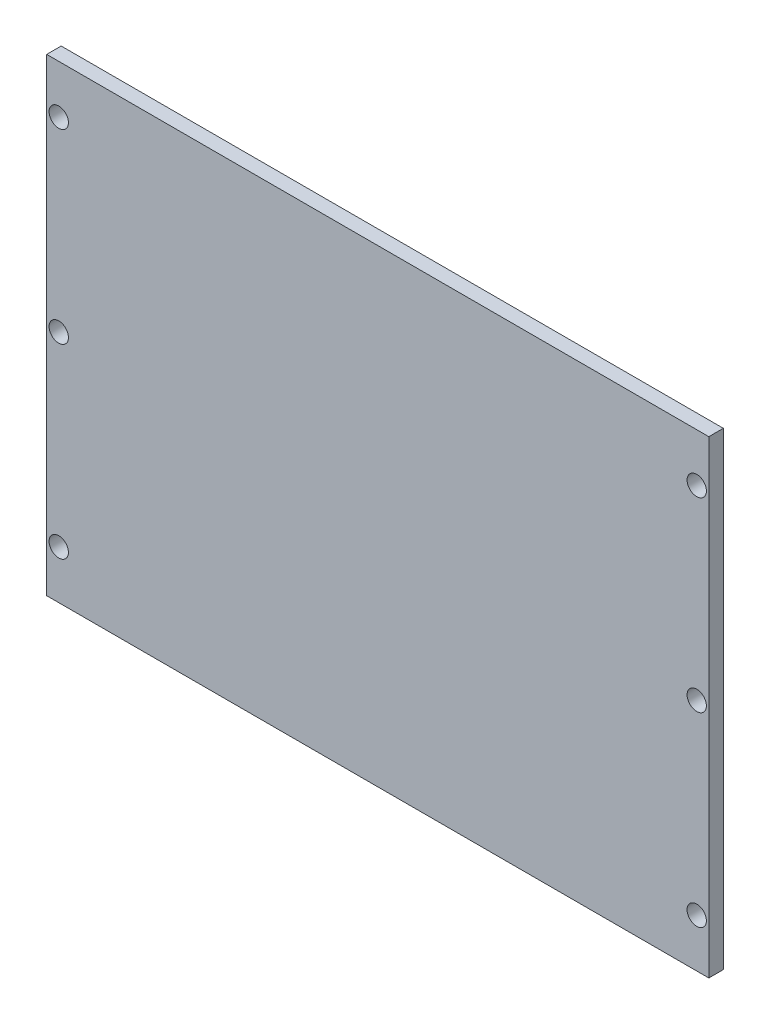
ISO-10303-21;
HEADER;
FILE_DESCRIPTION(('STEP AP214'),'2;1');
FILE_NAME('part.step','',(''),(''),'','','');
FILE_SCHEMA(('AUTOMOTIVE_DESIGN { 1 0 10303 214 1 1 1 1 }'));
ENDSEC;
DATA;
#1=APPLICATION_CONTEXT('core data for automotive mechanical design processes');
#2=APPLICATION_PROTOCOL_DEFINITION('international standard','automotive_design',2000,#1);
#3=PRODUCT_CONTEXT('',#1,'mechanical');
#4=PRODUCT('Part','Part','',(#3));
#5=PRODUCT_RELATED_PRODUCT_CATEGORY('part','',(#4));
#6=PRODUCT_DEFINITION_FORMATION('','',#4);
#7=PRODUCT_DEFINITION_CONTEXT('part definition',#1,'design');
#8=PRODUCT_DEFINITION('design','',#6,#7);
#9=PRODUCT_DEFINITION_SHAPE('','',#8);
#10=(LENGTH_UNIT() NAMED_UNIT(*) SI_UNIT(.MILLI.,.METRE.));
#11=(NAMED_UNIT(*) PLANE_ANGLE_UNIT() SI_UNIT($,.RADIAN.));
#12=(NAMED_UNIT(*) SI_UNIT($,.STERADIAN.) SOLID_ANGLE_UNIT());
#13=UNCERTAINTY_MEASURE_WITH_UNIT(LENGTH_MEASURE(1.E-05),#10,'distance_accuracy_value','');
#14=(GEOMETRIC_REPRESENTATION_CONTEXT(3) GLOBAL_UNCERTAINTY_ASSIGNED_CONTEXT((#13)) GLOBAL_UNIT_ASSIGNED_CONTEXT((#10,
#11,#12)) REPRESENTATION_CONTEXT('',''));
#15=CARTESIAN_POINT('',(0.,0.,0.));
#16=DIRECTION('',(0.,0.,1.));
#17=DIRECTION('',(1.,0.,0.));
#18=AXIS2_PLACEMENT_3D('',#15,#16,#17);
#19=CARTESIAN_POINT('',(30.,2.98999999999998,-206.202765486301));
#20=DIRECTION('',(1.,0.,0.));
#21=DIRECTION('',(0.,0.,-1.));
#22=AXIS2_PLACEMENT_3D('',#19,#20,#21);
#23=PLANE('',#22);
#24=DIRECTION('',(0.,1.,0.));
#25=VECTOR('',#24,1.);
#26=CARTESIAN_POINT('',(30.,2.98999999999998,-197.));
#27=LINE('',#26,#25);
#28=CARTESIAN_POINT('',(30.,3.,-197.));
#29=VERTEX_POINT('',#28);
#30=CARTESIAN_POINT('',(30.,100.,-197.));
#31=VERTEX_POINT('',#30);
#32=EDGE_CURVE('E41',#29,#31,#27,.T.);
#33=ORIENTED_EDGE('',*,*,#32,.T.);
#34=DIRECTION('',(0.,0.,1.));
#35=VECTOR('',#34,1.);
#36=CARTESIAN_POINT('',(30.,100.,-192.));
#37=LINE('',#36,#35);
#38=CARTESIAN_POINT('',(30.,100.,-200.));
#39=VERTEX_POINT('',#38);
#40=EDGE_CURVE('E86',#39,#31,#37,.T.);
#41=ORIENTED_EDGE('',*,*,#40,.F.);
#42=DIRECTION('',(0.,1.,0.));
#43=VECTOR('',#42,1.);
#44=CARTESIAN_POINT('',(30.,100.,-200.));
#45=LINE('',#44,#43);
#46=CARTESIAN_POINT('',(30.,3.,-200.));
#47=VERTEX_POINT('',#46);
#48=EDGE_CURVE('E95',#47,#39,#45,.T.);
#49=ORIENTED_EDGE('',*,*,#48,.F.);
#50=DIRECTION('',(0.,0.,-1.));
#51=VECTOR('',#50,1.);
#52=CARTESIAN_POINT('',(29.9999999999999,3.,0.0100000000000213));
#53=LINE('',#52,#51);
#54=EDGE_CURVE('E62',#29,#47,#53,.T.);
#55=ORIENTED_EDGE('',*,*,#54,.F.);
#56=EDGE_LOOP('',(#33,#41,#49,#55));
#57=FACE_BOUND('',#56,.T.);
#58=ADVANCED_FACE('F37',(#57),#23,.F.);
#59=CARTESIAN_POINT('',(167.,2.98999999999998,-207.082295416591));
#60=DIRECTION('',(-1.,0.,0.));
#61=DIRECTION('',(0.,0.,1.));
#62=AXIS2_PLACEMENT_3D('',#59,#60,#61);
#63=PLANE('',#62);
#64=DIRECTION('',(0.,-1.,0.));
#65=VECTOR('',#64,1.);
#66=CARTESIAN_POINT('',(167.,100.,-200.));
#67=LINE('',#66,#65);
#68=CARTESIAN_POINT('',(167.,100.,-200.));
#69=VERTEX_POINT('',#68);
#70=CARTESIAN_POINT('',(167.,2.99999999999998,-200.));
#71=VERTEX_POINT('',#70);
#72=EDGE_CURVE('E93',#69,#71,#67,.T.);
#73=ORIENTED_EDGE('',*,*,#72,.F.);
#74=DIRECTION('',(0.,0.,-1.));
#75=VECTOR('',#74,1.);
#76=CARTESIAN_POINT('',(167.,100.,-192.));
#77=LINE('',#76,#75);
#78=CARTESIAN_POINT('',(167.,100.,-197.));
#79=VERTEX_POINT('',#78);
#80=EDGE_CURVE('E84',#79,#69,#77,.T.);
#81=ORIENTED_EDGE('',*,*,#80,.F.);
#82=DIRECTION('',(0.,1.,0.));
#83=VECTOR('',#82,1.);
#84=CARTESIAN_POINT('',(167.,2.98999999999998,-197.));
#85=LINE('',#84,#83);
#86=CARTESIAN_POINT('',(167.,2.99999999999998,-197.));
#87=VERTEX_POINT('',#86);
#88=EDGE_CURVE('E92',#87,#79,#85,.T.);
#89=ORIENTED_EDGE('',*,*,#88,.F.);
#90=DIRECTION('',(0.,0.,1.));
#91=VECTOR('',#90,1.);
#92=CARTESIAN_POINT('',(167.,2.99999999999998,0.01000000000001));
#93=LINE('',#92,#91);
#94=EDGE_CURVE('E54',#71,#87,#93,.T.);
#95=ORIENTED_EDGE('',*,*,#94,.F.);
#96=EDGE_LOOP('',(#73,#81,#89,#95));
#97=FACE_BOUND('',#96,.T.);
#98=ADVANCED_FACE('F91',(#97),#63,.F.);
#99=CARTESIAN_POINT('',(167.,2.98999999999998,-197.));
#100=DIRECTION('',(0.,0.,-1.));
#101=DIRECTION('',(-1.,0.,0.));
#102=AXIS2_PLACEMENT_3D('',#99,#100,#101);
#103=PLANE('',#102);
#104=CARTESIAN_POINT('',(32.5,90.,-197.));
#105=DIRECTION('',(0.,0.,1.));
#106=DIRECTION('',(1.,0.,0.));
#107=AXIS2_PLACEMENT_3D('',#104,#105,#106);
#108=CIRCLE('',#107,1.99999999999999);
#109=CARTESIAN_POINT('',(34.5,90.,-197.));
#110=VERTEX_POINT('',#109);
#111=EDGE_CURVE('E144',#110,#110,#108,.T.);
#112=ORIENTED_EDGE('',*,*,#111,.F.);
#113=EDGE_LOOP('',(#112));
#114=FACE_BOUND('',#113,.T.);
#115=CARTESIAN_POINT('',(32.5,51.5,-197.));
#116=DIRECTION('',(0.,0.,1.));
#117=DIRECTION('',(1.,0.,0.));
#118=AXIS2_PLACEMENT_3D('',#115,#116,#117);
#119=CIRCLE('',#118,1.99999999999999);
#120=CARTESIAN_POINT('',(34.5,51.5,-197.));
#121=VERTEX_POINT('',#120);
#122=EDGE_CURVE('E138',#121,#121,#119,.T.);
#123=ORIENTED_EDGE('',*,*,#122,.F.);
#124=EDGE_LOOP('',(#123));
#125=FACE_BOUND('',#124,.T.);
#126=CARTESIAN_POINT('',(32.5,13.,-197.));
#127=DIRECTION('',(0.,0.,1.));
#128=DIRECTION('',(1.,0.,0.));
#129=AXIS2_PLACEMENT_3D('',#126,#127,#128);
#130=CIRCLE('',#129,1.99999999999999);
#131=CARTESIAN_POINT('',(34.5,13.,-197.));
#132=VERTEX_POINT('',#131);
#133=EDGE_CURVE('E132',#132,#132,#130,.T.);
#134=ORIENTED_EDGE('',*,*,#133,.F.);
#135=EDGE_LOOP('',(#134));
#136=FACE_BOUND('',#135,.T.);
#137=CARTESIAN_POINT('',(164.5,13.,-197.));
#138=DIRECTION('',(0.,0.,1.));
#139=DIRECTION('',(1.,0.,0.));
#140=AXIS2_PLACEMENT_3D('',#137,#138,#139);
#141=CIRCLE('',#140,2.);
#142=CARTESIAN_POINT('',(166.5,13.,-197.));
#143=VERTEX_POINT('',#142);
#144=EDGE_CURVE('E126',#143,#143,#141,.T.);
#145=ORIENTED_EDGE('',*,*,#144,.F.);
#146=EDGE_LOOP('',(#145));
#147=FACE_BOUND('',#146,.T.);
#148=CARTESIAN_POINT('',(164.5,51.5,-197.));
#149=DIRECTION('',(0.,0.,1.));
#150=DIRECTION('',(1.,0.,0.));
#151=AXIS2_PLACEMENT_3D('',#148,#149,#150);
#152=CIRCLE('',#151,2.);
#153=CARTESIAN_POINT('',(166.5,51.5,-197.));
#154=VERTEX_POINT('',#153);
#155=EDGE_CURVE('E120',#154,#154,#152,.T.);
#156=ORIENTED_EDGE('',*,*,#155,.F.);
#157=EDGE_LOOP('',(#156));
#158=FACE_BOUND('',#157,.T.);
#159=CARTESIAN_POINT('',(164.5,90.,-197.));
#160=DIRECTION('',(0.,0.,1.));
#161=DIRECTION('',(1.,0.,0.));
#162=AXIS2_PLACEMENT_3D('',#159,#160,#161);
#163=CIRCLE('',#162,2.);
#164=CARTESIAN_POINT('',(166.5,90.,-197.));
#165=VERTEX_POINT('',#164);
#166=EDGE_CURVE('E102',#165,#165,#163,.T.);
#167=ORIENTED_EDGE('',*,*,#166,.F.);
#168=EDGE_LOOP('',(#167));
#169=FACE_BOUND('',#168,.T.);
#170=ORIENTED_EDGE('',*,*,#88,.T.);
#171=DIRECTION('',(-1.,0.,0.));
#172=VECTOR('',#171,1.);
#173=CARTESIAN_POINT('',(162.,100.,-197.));
#174=LINE('',#173,#172);
#175=EDGE_CURVE('E11',#79,#31,#174,.T.);
#176=ORIENTED_EDGE('',*,*,#175,.T.);
#177=ORIENTED_EDGE('',*,*,#32,.F.);
#178=DIRECTION('',(-1.,0.,0.));
#179=VECTOR('',#178,1.);
#180=CARTESIAN_POINT('',(162.,3.,-197.));
#181=LINE('',#180,#179);
#182=EDGE_CURVE('E98',#87,#29,#181,.T.);
#183=ORIENTED_EDGE('',*,*,#182,.F.);
#184=EDGE_LOOP('',(#170,#176,#177,#183));
#185=FACE_BOUND('',#184,.T.);
#186=ADVANCED_FACE('F97',(#114,#125,#136,#147,#158,#169,#185),#103,.F.);
#187=CARTESIAN_POINT('',(8.,100.,-192.));
#188=DIRECTION('',(0.,-1.,0.));
#189=DIRECTION('',(0.,0.,-1.));
#190=AXIS2_PLACEMENT_3D('',#187,#188,#189);
#191=PLANE('',#190);
#192=ORIENTED_EDGE('',*,*,#40,.T.);
#193=ORIENTED_EDGE('',*,*,#175,.F.);
#194=ORIENTED_EDGE('',*,*,#80,.T.);
#195=DIRECTION('',(-1.,0.,0.));
#196=VECTOR('',#195,1.);
#197=CARTESIAN_POINT('',(8.00000000000006,100.,-200.));
#198=LINE('',#197,#196);
#199=EDGE_CURVE('E46',#69,#39,#198,.T.);
#200=ORIENTED_EDGE('',*,*,#199,.T.);
#201=EDGE_LOOP('',(#192,#193,#194,#200));
#202=FACE_BOUND('',#201,.T.);
#203=ADVANCED_FACE('F82',(#202),#191,.F.);
#204=CARTESIAN_POINT('',(0.,3.,0.01000000000001));
#205=DIRECTION('',(0.,1.,0.));
#206=DIRECTION('',(-1.,0.,0.));
#207=AXIS2_PLACEMENT_3D('',#204,#205,#206);
#208=PLANE('',#207);
#209=ORIENTED_EDGE('',*,*,#182,.T.);
#210=ORIENTED_EDGE('',*,*,#54,.T.);
#211=DIRECTION('',(-1.,0.,0.));
#212=VECTOR('',#211,1.);
#213=CARTESIAN_POINT('',(8.00000000000004,3.,-200.));
#214=LINE('',#213,#212);
#215=EDGE_CURVE('E106',#71,#47,#214,.T.);
#216=ORIENTED_EDGE('',*,*,#215,.F.);
#217=ORIENTED_EDGE('',*,*,#94,.T.);
#218=EDGE_LOOP('',(#209,#210,#216,#217));
#219=FACE_BOUND('',#218,.T.);
#220=ADVANCED_FACE('F39',(#219),#208,.F.);
#221=CARTESIAN_POINT('',(8.00000000000006,100.,-200.));
#222=DIRECTION('',(0.,0.,1.));
#223=DIRECTION('',(1.,0.,0.));
#224=AXIS2_PLACEMENT_3D('',#221,#222,#223);
#225=PLANE('',#224);
#226=CARTESIAN_POINT('',(32.5,90.,-200.));
#227=DIRECTION('',(0.,0.,1.));
#228=DIRECTION('',(1.,0.,0.));
#229=AXIS2_PLACEMENT_3D('',#226,#227,#228);
#230=CIRCLE('',#229,2.);
#231=CARTESIAN_POINT('',(34.5,90.,-200.));
#232=VERTEX_POINT('',#231);
#233=EDGE_CURVE('E141',#232,#232,#230,.T.);
#234=ORIENTED_EDGE('',*,*,#233,.T.);
#235=EDGE_LOOP('',(#234));
#236=FACE_BOUND('',#235,.T.);
#237=CARTESIAN_POINT('',(32.5,51.5,-200.));
#238=DIRECTION('',(0.,0.,1.));
#239=DIRECTION('',(1.,0.,0.));
#240=AXIS2_PLACEMENT_3D('',#237,#238,#239);
#241=CIRCLE('',#240,2.);
#242=CARTESIAN_POINT('',(34.5,51.5,-200.));
#243=VERTEX_POINT('',#242);
#244=EDGE_CURVE('E135',#243,#243,#241,.T.);
#245=ORIENTED_EDGE('',*,*,#244,.T.);
#246=EDGE_LOOP('',(#245));
#247=FACE_BOUND('',#246,.T.);
#248=CARTESIAN_POINT('',(32.5,13.,-200.));
#249=DIRECTION('',(0.,0.,1.));
#250=DIRECTION('',(1.,0.,0.));
#251=AXIS2_PLACEMENT_3D('',#248,#249,#250);
#252=CIRCLE('',#251,2.);
#253=CARTESIAN_POINT('',(34.5,13.,-200.));
#254=VERTEX_POINT('',#253);
#255=EDGE_CURVE('E129',#254,#254,#252,.T.);
#256=ORIENTED_EDGE('',*,*,#255,.T.);
#257=EDGE_LOOP('',(#256));
#258=FACE_BOUND('',#257,.T.);
#259=CARTESIAN_POINT('',(164.5,13.,-200.));
#260=DIRECTION('',(0.,0.,1.));
#261=DIRECTION('',(1.,0.,0.));
#262=AXIS2_PLACEMENT_3D('',#259,#260,#261);
#263=CIRCLE('',#262,2.);
#264=CARTESIAN_POINT('',(166.5,13.,-200.));
#265=VERTEX_POINT('',#264);
#266=EDGE_CURVE('E123',#265,#265,#263,.T.);
#267=ORIENTED_EDGE('',*,*,#266,.T.);
#268=EDGE_LOOP('',(#267));
#269=FACE_BOUND('',#268,.T.);
#270=CARTESIAN_POINT('',(164.5,51.5,-200.));
#271=DIRECTION('',(0.,0.,1.));
#272=DIRECTION('',(1.,0.,0.));
#273=AXIS2_PLACEMENT_3D('',#270,#271,#272);
#274=CIRCLE('',#273,2.);
#275=CARTESIAN_POINT('',(166.5,51.5,-200.));
#276=VERTEX_POINT('',#275);
#277=EDGE_CURVE('E117',#276,#276,#274,.T.);
#278=ORIENTED_EDGE('',*,*,#277,.T.);
#279=EDGE_LOOP('',(#278));
#280=FACE_BOUND('',#279,.T.);
#281=CARTESIAN_POINT('',(164.5,90.,-200.));
#282=DIRECTION('',(0.,0.,1.));
#283=DIRECTION('',(1.,0.,0.));
#284=AXIS2_PLACEMENT_3D('',#281,#282,#283);
#285=CIRCLE('',#284,2.);
#286=CARTESIAN_POINT('',(166.5,90.,-200.));
#287=VERTEX_POINT('',#286);
#288=EDGE_CURVE('E99',#287,#287,#285,.T.);
#289=ORIENTED_EDGE('',*,*,#288,.T.);
#290=EDGE_LOOP('',(#289));
#291=FACE_BOUND('',#290,.T.);
#292=ORIENTED_EDGE('',*,*,#215,.T.);
#293=ORIENTED_EDGE('',*,*,#48,.T.);
#294=ORIENTED_EDGE('',*,*,#199,.F.);
#295=ORIENTED_EDGE('',*,*,#72,.T.);
#296=EDGE_LOOP('',(#292,#293,#294,#295));
#297=FACE_BOUND('',#296,.T.);
#298=ADVANCED_FACE('F153',(#236,#247,#258,#269,#280,#291,#297),#225,.F.);
#299=CARTESIAN_POINT('',(164.5,90.,-197.));
#300=DIRECTION('',(0.,0.,1.));
#301=DIRECTION('',(1.,0.,0.));
#302=AXIS2_PLACEMENT_3D('',#299,#300,#301);
#303=CYLINDRICAL_SURFACE('',#302,2.);
#304=ORIENTED_EDGE('',*,*,#288,.F.);
#305=EDGE_LOOP('',(#304));
#306=FACE_BOUND('',#305,.T.);
#307=ORIENTED_EDGE('',*,*,#166,.T.);
#308=EDGE_LOOP('',(#307));
#309=FACE_BOUND('',#308,.T.);
#310=ADVANCED_FACE('F164',(#306,#309),#303,.F.);
#311=CARTESIAN_POINT('',(164.5,51.5,-197.));
#312=DIRECTION('',(0.,0.,1.));
#313=DIRECTION('',(1.,0.,0.));
#314=AXIS2_PLACEMENT_3D('',#311,#312,#313);
#315=CYLINDRICAL_SURFACE('',#314,2.);
#316=ORIENTED_EDGE('',*,*,#277,.F.);
#317=EDGE_LOOP('',(#316));
#318=FACE_BOUND('',#317,.T.);
#319=ORIENTED_EDGE('',*,*,#155,.T.);
#320=EDGE_LOOP('',(#319));
#321=FACE_BOUND('',#320,.T.);
#322=ADVANCED_FACE('F166',(#318,#321),#315,.F.);
#323=CARTESIAN_POINT('',(164.5,13.,-197.));
#324=DIRECTION('',(0.,0.,1.));
#325=DIRECTION('',(1.,0.,0.));
#326=AXIS2_PLACEMENT_3D('',#323,#324,#325);
#327=CYLINDRICAL_SURFACE('',#326,2.);
#328=ORIENTED_EDGE('',*,*,#266,.F.);
#329=EDGE_LOOP('',(#328));
#330=FACE_BOUND('',#329,.T.);
#331=ORIENTED_EDGE('',*,*,#144,.T.);
#332=EDGE_LOOP('',(#331));
#333=FACE_BOUND('',#332,.T.);
#334=ADVANCED_FACE('F173',(#330,#333),#327,.F.);
#335=CARTESIAN_POINT('',(32.5,13.,-197.));
#336=DIRECTION('',(0.,0.,1.));
#337=DIRECTION('',(1.,0.,0.));
#338=AXIS2_PLACEMENT_3D('',#335,#336,#337);
#339=CYLINDRICAL_SURFACE('',#338,1.99999999999999);
#340=ORIENTED_EDGE('',*,*,#255,.F.);
#341=EDGE_LOOP('',(#340));
#342=FACE_BOUND('',#341,.T.);
#343=ORIENTED_EDGE('',*,*,#133,.T.);
#344=EDGE_LOOP('',(#343));
#345=FACE_BOUND('',#344,.T.);
#346=ADVANCED_FACE('F218',(#342,#345),#339,.F.);
#347=CARTESIAN_POINT('',(32.5,51.5,-197.));
#348=DIRECTION('',(0.,0.,1.));
#349=DIRECTION('',(1.,0.,0.));
#350=AXIS2_PLACEMENT_3D('',#347,#348,#349);
#351=CYLINDRICAL_SURFACE('',#350,1.99999999999999);
#352=ORIENTED_EDGE('',*,*,#244,.F.);
#353=EDGE_LOOP('',(#352));
#354=FACE_BOUND('',#353,.T.);
#355=ORIENTED_EDGE('',*,*,#122,.T.);
#356=EDGE_LOOP('',(#355));
#357=FACE_BOUND('',#356,.T.);
#358=ADVANCED_FACE('F228',(#354,#357),#351,.F.);
#359=CARTESIAN_POINT('',(32.5,90.,-197.));
#360=DIRECTION('',(0.,0.,1.));
#361=DIRECTION('',(1.,0.,0.));
#362=AXIS2_PLACEMENT_3D('',#359,#360,#361);
#363=CYLINDRICAL_SURFACE('',#362,1.99999999999999);
#364=ORIENTED_EDGE('',*,*,#233,.F.);
#365=EDGE_LOOP('',(#364));
#366=FACE_BOUND('',#365,.T.);
#367=ORIENTED_EDGE('',*,*,#111,.T.);
#368=EDGE_LOOP('',(#367));
#369=FACE_BOUND('',#368,.T.);
#370=ADVANCED_FACE('F148',(#366,#369),#363,.F.);
#371=CLOSED_SHELL('',(#58,#98,#186,#203,#220,#298,#310,#322,#334,#346,#358,#370));
#372=MANIFOLD_SOLID_BREP('B2',#371);
#373=ADVANCED_BREP_SHAPE_REPRESENTATION('',(#18,#372),#14);
#374=SHAPE_DEFINITION_REPRESENTATION(#9,#373);
ENDSEC;
END-ISO-10303-21;
